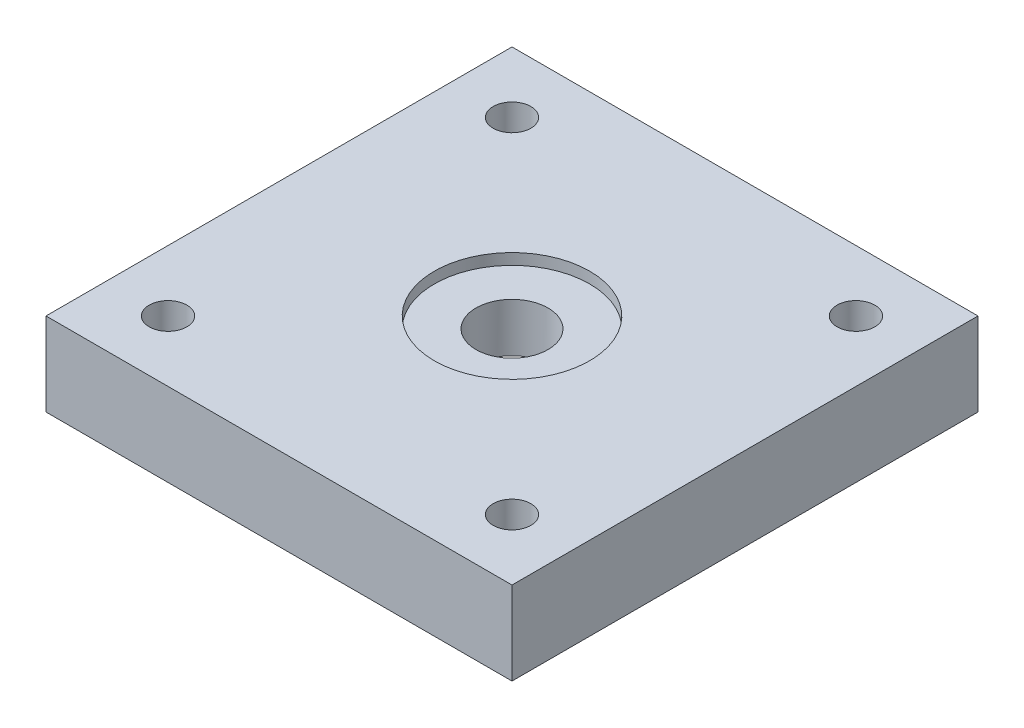
ISO-10303-21;
HEADER;
FILE_DESCRIPTION(('STEP AP214'),'2;1');
FILE_NAME('part.step','',(''),(''),'','','');
FILE_SCHEMA(('AUTOMOTIVE_DESIGN { 1 0 10303 214 1 1 1 1 }'));
ENDSEC;
DATA;
#1=APPLICATION_CONTEXT('core data for automotive mechanical design processes');
#2=APPLICATION_PROTOCOL_DEFINITION('international standard','automotive_design',2000,#1);
#3=PRODUCT_CONTEXT('',#1,'mechanical');
#4=PRODUCT('Part','Part','',(#3));
#5=PRODUCT_RELATED_PRODUCT_CATEGORY('part','',(#4));
#6=PRODUCT_DEFINITION_FORMATION('','',#4);
#7=PRODUCT_DEFINITION_CONTEXT('part definition',#1,'design');
#8=PRODUCT_DEFINITION('design','',#6,#7);
#9=PRODUCT_DEFINITION_SHAPE('','',#8);
#10=(LENGTH_UNIT() NAMED_UNIT(*) SI_UNIT(.MILLI.,.METRE.));
#11=(NAMED_UNIT(*) PLANE_ANGLE_UNIT() SI_UNIT($,.RADIAN.));
#12=(NAMED_UNIT(*) SI_UNIT($,.STERADIAN.) SOLID_ANGLE_UNIT());
#13=UNCERTAINTY_MEASURE_WITH_UNIT(LENGTH_MEASURE(1.E-05),#10,'distance_accuracy_value','');
#14=(GEOMETRIC_REPRESENTATION_CONTEXT(3) GLOBAL_UNCERTAINTY_ASSIGNED_CONTEXT((#13)) GLOBAL_UNIT_ASSIGNED_CONTEXT((#10,
#11,#12)) REPRESENTATION_CONTEXT('',''));
#15=CARTESIAN_POINT('',(0.,0.,0.));
#16=DIRECTION('',(0.,0.,1.));
#17=DIRECTION('',(1.,0.,0.));
#18=AXIS2_PLACEMENT_3D('',#15,#16,#17);
#19=CARTESIAN_POINT('',(0.,7.5,0.));
#20=DIRECTION('',(0.,-1.,0.));
#21=DIRECTION('',(0.,0.,-1.));
#22=AXIS2_PLACEMENT_3D('',#19,#20,#21);
#23=PLANE('',#22);
#24=CARTESIAN_POINT('',(0.,7.5,0.));
#25=DIRECTION('',(0.,1.,0.));
#26=DIRECTION('',(0.,0.,1.));
#27=AXIS2_PLACEMENT_3D('',#24,#25,#26);
#28=CIRCLE('',#27,7.);
#29=CARTESIAN_POINT('',(0.,7.5,7.));
#30=VERTEX_POINT('',#29);
#31=EDGE_CURVE('E174',#30,#30,#28,.T.);
#32=ORIENTED_EDGE('',*,*,#31,.F.);
#33=EDGE_LOOP('',(#32));
#34=FACE_BOUND('',#33,.T.);
#35=DIRECTION('',(0.,0.,-1.));
#36=VECTOR('',#35,1.);
#37=CARTESIAN_POINT('',(21.,7.5,21.));
#38=LINE('',#37,#36);
#39=CARTESIAN_POINT('',(21.,7.5,21.));
#40=VERTEX_POINT('',#39);
#41=CARTESIAN_POINT('',(21.,7.5,-21.));
#42=VERTEX_POINT('',#41);
#43=EDGE_CURVE('E92',#40,#42,#38,.T.);
#44=ORIENTED_EDGE('',*,*,#43,.T.);
#45=DIRECTION('',(-1.,0.,0.));
#46=VECTOR('',#45,1.);
#47=CARTESIAN_POINT('',(-21.,7.5,-21.));
#48=LINE('',#47,#46);
#49=CARTESIAN_POINT('',(-21.,7.5,-21.));
#50=VERTEX_POINT('',#49);
#51=EDGE_CURVE('E87',#42,#50,#48,.T.);
#52=ORIENTED_EDGE('',*,*,#51,.T.);
#53=DIRECTION('',(0.,0.,1.));
#54=VECTOR('',#53,1.);
#55=CARTESIAN_POINT('',(-21.,7.5,21.));
#56=LINE('',#55,#54);
#57=CARTESIAN_POINT('',(-21.,7.5,21.));
#58=VERTEX_POINT('',#57);
#59=EDGE_CURVE('E90',#50,#58,#56,.T.);
#60=ORIENTED_EDGE('',*,*,#59,.T.);
#61=DIRECTION('',(1.,0.,0.));
#62=VECTOR('',#61,1.);
#63=CARTESIAN_POINT('',(-21.,7.5,21.));
#64=LINE('',#63,#62);
#65=EDGE_CURVE('E57',#58,#40,#64,.T.);
#66=ORIENTED_EDGE('',*,*,#65,.T.);
#67=EDGE_LOOP('',(#44,#52,#60,#66));
#68=FACE_BOUND('',#67,.T.);
#69=CARTESIAN_POINT('',(-15.5,7.5,-15.5));
#70=DIRECTION('',(0.,1.,0.));
#71=DIRECTION('',(0.,0.,1.));
#72=AXIS2_PLACEMENT_3D('',#69,#70,#71);
#73=CIRCLE('',#72,1.7);
#74=CARTESIAN_POINT('',(-15.5,7.5,-13.8));
#75=VERTEX_POINT('',#74);
#76=EDGE_CURVE('E114',#75,#75,#73,.T.);
#77=ORIENTED_EDGE('',*,*,#76,.F.);
#78=EDGE_LOOP('',(#77));
#79=FACE_BOUND('',#78,.T.);
#80=CARTESIAN_POINT('',(15.5,7.5,-15.5));
#81=DIRECTION('',(0.,1.,0.));
#82=DIRECTION('',(0.,0.,1.));
#83=AXIS2_PLACEMENT_3D('',#80,#81,#82);
#84=CIRCLE('',#83,1.7);
#85=CARTESIAN_POINT('',(15.5,7.5,-13.8));
#86=VERTEX_POINT('',#85);
#87=EDGE_CURVE('E138',#86,#86,#84,.T.);
#88=ORIENTED_EDGE('',*,*,#87,.F.);
#89=EDGE_LOOP('',(#88));
#90=FACE_BOUND('',#89,.T.);
#91=CARTESIAN_POINT('',(15.5,7.5,15.5));
#92=DIRECTION('',(0.,1.,0.));
#93=DIRECTION('',(0.,0.,1.));
#94=AXIS2_PLACEMENT_3D('',#91,#92,#93);
#95=CIRCLE('',#94,1.7);
#96=CARTESIAN_POINT('',(15.5,7.5,17.2));
#97=VERTEX_POINT('',#96);
#98=EDGE_CURVE('E146',#97,#97,#95,.T.);
#99=ORIENTED_EDGE('',*,*,#98,.F.);
#100=EDGE_LOOP('',(#99));
#101=FACE_BOUND('',#100,.T.);
#102=CARTESIAN_POINT('',(-15.5,7.5,15.5));
#103=DIRECTION('',(0.,1.,0.));
#104=DIRECTION('',(0.,0.,1.));
#105=AXIS2_PLACEMENT_3D('',#102,#103,#104);
#106=CIRCLE('',#105,1.7);
#107=CARTESIAN_POINT('',(-15.5,7.5,17.2));
#108=VERTEX_POINT('',#107);
#109=EDGE_CURVE('E154',#108,#108,#106,.T.);
#110=ORIENTED_EDGE('',*,*,#109,.F.);
#111=EDGE_LOOP('',(#110));
#112=FACE_BOUND('',#111,.T.);
#113=ADVANCED_FACE('F38',(#34,#68,#79,#90,#101,#112),#23,.F.);
#114=CARTESIAN_POINT('',(0.,0.,0.));
#115=DIRECTION('',(0.,-1.,0.));
#116=DIRECTION('',(0.,0.,-1.));
#117=AXIS2_PLACEMENT_3D('',#114,#115,#116);
#118=PLANE('',#117);
#119=CARTESIAN_POINT('',(0.,0.,0.));
#120=DIRECTION('',(0.,-1.,0.));
#121=DIRECTION('',(0.,0.,-1.));
#122=AXIS2_PLACEMENT_3D('',#119,#120,#121);
#123=CIRCLE('',#122,11.);
#124=CARTESIAN_POINT('',(0.,0.,-11.));
#125=VERTEX_POINT('',#124);
#126=EDGE_CURVE('E166',#125,#125,#123,.T.);
#127=ORIENTED_EDGE('',*,*,#126,.F.);
#128=EDGE_LOOP('',(#127));
#129=FACE_BOUND('',#128,.T.);
#130=CARTESIAN_POINT('',(15.5,0.,15.5));
#131=DIRECTION('',(0.,1.,0.));
#132=DIRECTION('',(0.,0.,1.));
#133=AXIS2_PLACEMENT_3D('',#130,#131,#132);
#134=CIRCLE('',#133,1.7);
#135=CARTESIAN_POINT('',(15.5,0.,17.2));
#136=VERTEX_POINT('',#135);
#137=EDGE_CURVE('E150',#136,#136,#134,.T.);
#138=ORIENTED_EDGE('',*,*,#137,.T.);
#139=EDGE_LOOP('',(#138));
#140=FACE_BOUND('',#139,.T.);
#141=CARTESIAN_POINT('',(-15.5,0.,-15.5));
#142=DIRECTION('',(0.,1.,0.));
#143=DIRECTION('',(0.,0.,1.));
#144=AXIS2_PLACEMENT_3D('',#141,#142,#143);
#145=CIRCLE('',#144,1.7);
#146=CARTESIAN_POINT('',(-15.5,0.,-13.8));
#147=VERTEX_POINT('',#146);
#148=EDGE_CURVE('E134',#147,#147,#145,.T.);
#149=ORIENTED_EDGE('',*,*,#148,.T.);
#150=EDGE_LOOP('',(#149));
#151=FACE_BOUND('',#150,.T.);
#152=DIRECTION('',(0.,0.,-1.));
#153=VECTOR('',#152,1.);
#154=CARTESIAN_POINT('',(21.,0.,21.));
#155=LINE('',#154,#153);
#156=CARTESIAN_POINT('',(21.,0.,21.));
#157=VERTEX_POINT('',#156);
#158=CARTESIAN_POINT('',(21.,0.,-21.));
#159=VERTEX_POINT('',#158);
#160=EDGE_CURVE('E110',#157,#159,#155,.T.);
#161=ORIENTED_EDGE('',*,*,#160,.F.);
#162=DIRECTION('',(1.,0.,0.));
#163=VECTOR('',#162,1.);
#164=CARTESIAN_POINT('',(-21.,0.,21.));
#165=LINE('',#164,#163);
#166=CARTESIAN_POINT('',(-21.,0.,21.));
#167=VERTEX_POINT('',#166);
#168=EDGE_CURVE('E80',#167,#157,#165,.T.);
#169=ORIENTED_EDGE('',*,*,#168,.F.);
#170=DIRECTION('',(0.,0.,1.));
#171=VECTOR('',#170,1.);
#172=CARTESIAN_POINT('',(-21.,0.,21.));
#173=LINE('',#172,#171);
#174=CARTESIAN_POINT('',(-21.,0.,-21.));
#175=VERTEX_POINT('',#174);
#176=EDGE_CURVE('E74',#175,#167,#173,.T.);
#177=ORIENTED_EDGE('',*,*,#176,.F.);
#178=DIRECTION('',(-1.,0.,0.));
#179=VECTOR('',#178,1.);
#180=CARTESIAN_POINT('',(-21.,0.,-21.));
#181=LINE('',#180,#179);
#182=EDGE_CURVE('E97',#159,#175,#181,.T.);
#183=ORIENTED_EDGE('',*,*,#182,.F.);
#184=EDGE_LOOP('',(#161,#169,#177,#183));
#185=FACE_BOUND('',#184,.T.);
#186=CARTESIAN_POINT('',(15.5,0.,-15.5));
#187=DIRECTION('',(0.,1.,0.));
#188=DIRECTION('',(0.,0.,1.));
#189=AXIS2_PLACEMENT_3D('',#186,#187,#188);
#190=CIRCLE('',#189,1.7);
#191=CARTESIAN_POINT('',(15.5,0.,-13.8));
#192=VERTEX_POINT('',#191);
#193=EDGE_CURVE('E142',#192,#192,#190,.T.);
#194=ORIENTED_EDGE('',*,*,#193,.T.);
#195=EDGE_LOOP('',(#194));
#196=FACE_BOUND('',#195,.T.);
#197=CARTESIAN_POINT('',(-15.5,0.,15.5));
#198=DIRECTION('',(0.,1.,0.));
#199=DIRECTION('',(0.,0.,1.));
#200=AXIS2_PLACEMENT_3D('',#197,#198,#199);
#201=CIRCLE('',#200,1.7);
#202=CARTESIAN_POINT('',(-15.5,0.,17.2));
#203=VERTEX_POINT('',#202);
#204=EDGE_CURVE('E158',#203,#203,#201,.T.);
#205=ORIENTED_EDGE('',*,*,#204,.T.);
#206=EDGE_LOOP('',(#205));
#207=FACE_BOUND('',#206,.T.);
#208=ADVANCED_FACE('F128',(#129,#140,#151,#185,#196,#207),#118,.T.);
#209=CARTESIAN_POINT('',(21.,7.5,21.));
#210=DIRECTION('',(-1.,0.,0.));
#211=DIRECTION('',(0.,0.,1.));
#212=AXIS2_PLACEMENT_3D('',#209,#210,#211);
#213=PLANE('',#212);
#214=ORIENTED_EDGE('',*,*,#160,.T.);
#215=DIRECTION('',(0.,-1.,0.));
#216=VECTOR('',#215,1.);
#217=CARTESIAN_POINT('',(21.,7.5,-21.));
#218=LINE('',#217,#216);
#219=EDGE_CURVE('E11',#42,#159,#218,.T.);
#220=ORIENTED_EDGE('',*,*,#219,.F.);
#221=ORIENTED_EDGE('',*,*,#43,.F.);
#222=DIRECTION('',(0.,-1.,0.));
#223=VECTOR('',#222,1.);
#224=CARTESIAN_POINT('',(21.,7.5,21.));
#225=LINE('',#224,#223);
#226=EDGE_CURVE('E106',#40,#157,#225,.T.);
#227=ORIENTED_EDGE('',*,*,#226,.T.);
#228=EDGE_LOOP('',(#214,#220,#221,#227));
#229=FACE_BOUND('',#228,.T.);
#230=ADVANCED_FACE('F40',(#229),#213,.F.);
#231=CARTESIAN_POINT('',(-21.,7.5,-21.));
#232=DIRECTION('',(0.,0.,1.));
#233=DIRECTION('',(1.,0.,0.));
#234=AXIS2_PLACEMENT_3D('',#231,#232,#233);
#235=PLANE('',#234);
#236=ORIENTED_EDGE('',*,*,#182,.T.);
#237=DIRECTION('',(0.,-1.,0.));
#238=VECTOR('',#237,1.);
#239=CARTESIAN_POINT('',(-21.,7.5,-21.));
#240=LINE('',#239,#238);
#241=EDGE_CURVE('E49',#50,#175,#240,.T.);
#242=ORIENTED_EDGE('',*,*,#241,.F.);
#243=ORIENTED_EDGE('',*,*,#51,.F.);
#244=ORIENTED_EDGE('',*,*,#219,.T.);
#245=EDGE_LOOP('',(#236,#242,#243,#244));
#246=FACE_BOUND('',#245,.T.);
#247=ADVANCED_FACE('F96',(#246),#235,.F.);
#248=CARTESIAN_POINT('',(-21.,7.5,21.));
#249=DIRECTION('',(1.,0.,0.));
#250=DIRECTION('',(0.,0.,-1.));
#251=AXIS2_PLACEMENT_3D('',#248,#249,#250);
#252=PLANE('',#251);
#253=ORIENTED_EDGE('',*,*,#176,.T.);
#254=DIRECTION('',(0.,-1.,0.));
#255=VECTOR('',#254,1.);
#256=CARTESIAN_POINT('',(-21.,7.5,21.));
#257=LINE('',#256,#255);
#258=EDGE_CURVE('E99',#58,#167,#257,.T.);
#259=ORIENTED_EDGE('',*,*,#258,.F.);
#260=ORIENTED_EDGE('',*,*,#59,.F.);
#261=ORIENTED_EDGE('',*,*,#241,.T.);
#262=EDGE_LOOP('',(#253,#259,#260,#261));
#263=FACE_BOUND('',#262,.T.);
#264=ADVANCED_FACE('F101',(#263),#252,.F.);
#265=CARTESIAN_POINT('',(-21.,7.5,21.));
#266=DIRECTION('',(0.,0.,-1.));
#267=DIRECTION('',(-1.,0.,0.));
#268=AXIS2_PLACEMENT_3D('',#265,#266,#267);
#269=PLANE('',#268);
#270=ORIENTED_EDGE('',*,*,#168,.T.);
#271=ORIENTED_EDGE('',*,*,#226,.F.);
#272=ORIENTED_EDGE('',*,*,#65,.F.);
#273=ORIENTED_EDGE('',*,*,#258,.T.);
#274=EDGE_LOOP('',(#270,#271,#272,#273));
#275=FACE_BOUND('',#274,.T.);
#276=ADVANCED_FACE('F125',(#275),#269,.F.);
#277=CARTESIAN_POINT('',(-15.5,7.5,-15.5));
#278=DIRECTION('',(0.,-1.,0.));
#279=DIRECTION('',(0.,0.,-1.));
#280=AXIS2_PLACEMENT_3D('',#277,#278,#279);
#281=CYLINDRICAL_SURFACE('',#280,1.7);
#282=ORIENTED_EDGE('',*,*,#76,.T.);
#283=EDGE_LOOP('',(#282));
#284=FACE_BOUND('',#283,.T.);
#285=ORIENTED_EDGE('',*,*,#148,.F.);
#286=EDGE_LOOP('',(#285));
#287=FACE_BOUND('',#286,.T.);
#288=ADVANCED_FACE('F215',(#284,#287),#281,.F.);
#289=CARTESIAN_POINT('',(15.5,7.5,-15.5));
#290=DIRECTION('',(0.,-1.,0.));
#291=DIRECTION('',(0.,0.,-1.));
#292=AXIS2_PLACEMENT_3D('',#289,#290,#291);
#293=CYLINDRICAL_SURFACE('',#292,1.7);
#294=ORIENTED_EDGE('',*,*,#87,.T.);
#295=EDGE_LOOP('',(#294));
#296=FACE_BOUND('',#295,.T.);
#297=ORIENTED_EDGE('',*,*,#193,.F.);
#298=EDGE_LOOP('',(#297));
#299=FACE_BOUND('',#298,.T.);
#300=ADVANCED_FACE('F217',(#296,#299),#293,.F.);
#301=CARTESIAN_POINT('',(15.5,7.5,15.5));
#302=DIRECTION('',(0.,-1.,0.));
#303=DIRECTION('',(0.,0.,-1.));
#304=AXIS2_PLACEMENT_3D('',#301,#302,#303);
#305=CYLINDRICAL_SURFACE('',#304,1.7);
#306=ORIENTED_EDGE('',*,*,#98,.T.);
#307=EDGE_LOOP('',(#306));
#308=FACE_BOUND('',#307,.T.);
#309=ORIENTED_EDGE('',*,*,#137,.F.);
#310=EDGE_LOOP('',(#309));
#311=FACE_BOUND('',#310,.T.);
#312=ADVANCED_FACE('F224',(#308,#311),#305,.F.);
#313=CARTESIAN_POINT('',(-15.5,7.5,15.5));
#314=DIRECTION('',(0.,-1.,0.));
#315=DIRECTION('',(0.,0.,-1.));
#316=AXIS2_PLACEMENT_3D('',#313,#314,#315);
#317=CYLINDRICAL_SURFACE('',#316,1.7);
#318=ORIENTED_EDGE('',*,*,#109,.T.);
#319=EDGE_LOOP('',(#318));
#320=FACE_BOUND('',#319,.T.);
#321=ORIENTED_EDGE('',*,*,#204,.F.);
#322=EDGE_LOOP('',(#321));
#323=FACE_BOUND('',#322,.T.);
#324=ADVANCED_FACE('F204',(#320,#323),#317,.F.);
#325=CARTESIAN_POINT('',(0.,2.1,0.));
#326=DIRECTION('',(0.,-1.,0.));
#327=DIRECTION('',(0.,0.,-1.));
#328=AXIS2_PLACEMENT_3D('',#325,#326,#327);
#329=CYLINDRICAL_SURFACE('',#328,11.);
#330=CARTESIAN_POINT('',(0.,2.1,0.));
#331=DIRECTION('',(0.,-1.,0.));
#332=DIRECTION('',(0.,0.,-1.));
#333=AXIS2_PLACEMENT_3D('',#330,#331,#332);
#334=CIRCLE('',#333,11.);
#335=CARTESIAN_POINT('',(0.,2.1,-11.));
#336=VERTEX_POINT('',#335);
#337=EDGE_CURVE('E162',#336,#336,#334,.T.);
#338=ORIENTED_EDGE('',*,*,#337,.F.);
#339=EDGE_LOOP('',(#338));
#340=FACE_BOUND('',#339,.T.);
#341=ORIENTED_EDGE('',*,*,#126,.T.);
#342=EDGE_LOOP('',(#341));
#343=FACE_BOUND('',#342,.T.);
#344=ADVANCED_FACE('F198',(#340,#343),#329,.F.);
#345=CARTESIAN_POINT('',(0.,2.1,0.));
#346=DIRECTION('',(0.,-1.,0.));
#347=DIRECTION('',(0.,0.,-1.));
#348=AXIS2_PLACEMENT_3D('',#345,#346,#347);
#349=PLANE('',#348);
#350=CARTESIAN_POINT('',(0.,2.1,0.));
#351=DIRECTION('',(0.,-1.,0.));
#352=DIRECTION('',(0.,0.,-1.));
#353=AXIS2_PLACEMENT_3D('',#350,#351,#352);
#354=CIRCLE('',#353,3.25);
#355=CARTESIAN_POINT('',(0.,2.1,-3.25));
#356=VERTEX_POINT('',#355);
#357=EDGE_CURVE('E42',#356,#356,#354,.T.);
#358=ORIENTED_EDGE('',*,*,#357,.F.);
#359=EDGE_LOOP('',(#358));
#360=FACE_BOUND('',#359,.T.);
#361=ORIENTED_EDGE('',*,*,#337,.T.);
#362=EDGE_LOOP('',(#361));
#363=FACE_BOUND('',#362,.T.);
#364=ADVANCED_FACE('F194',(#360,#363),#349,.T.);
#365=CARTESIAN_POINT('',(0.,6.5,0.));
#366=DIRECTION('',(0.,1.,0.));
#367=DIRECTION('',(0.,0.,1.));
#368=AXIS2_PLACEMENT_3D('',#365,#366,#367);
#369=CYLINDRICAL_SURFACE('',#368,7.);
#370=CARTESIAN_POINT('',(0.,6.5,0.));
#371=DIRECTION('',(0.,1.,0.));
#372=DIRECTION('',(0.,0.,1.));
#373=AXIS2_PLACEMENT_3D('',#370,#371,#372);
#374=CIRCLE('',#373,7.);
#375=CARTESIAN_POINT('',(0.,6.5,7.));
#376=VERTEX_POINT('',#375);
#377=EDGE_CURVE('E170',#376,#376,#374,.T.);
#378=ORIENTED_EDGE('',*,*,#377,.F.);
#379=EDGE_LOOP('',(#378));
#380=FACE_BOUND('',#379,.T.);
#381=ORIENTED_EDGE('',*,*,#31,.T.);
#382=EDGE_LOOP('',(#381));
#383=FACE_BOUND('',#382,.T.);
#384=ADVANCED_FACE('F197',(#380,#383),#369,.F.);
#385=CARTESIAN_POINT('',(0.,6.5,0.));
#386=DIRECTION('',(0.,1.,0.));
#387=DIRECTION('',(0.,0.,1.));
#388=AXIS2_PLACEMENT_3D('',#385,#386,#387);
#389=PLANE('',#388);
#390=CARTESIAN_POINT('',(0.,6.5,0.));
#391=DIRECTION('',(0.,1.,0.));
#392=DIRECTION('',(0.,0.,1.));
#393=AXIS2_PLACEMENT_3D('',#390,#391,#392);
#394=CIRCLE('',#393,3.25);
#395=CARTESIAN_POINT('',(0.,6.5,3.25));
#396=VERTEX_POINT('',#395);
#397=EDGE_CURVE('E181',#396,#396,#394,.T.);
#398=ORIENTED_EDGE('',*,*,#397,.F.);
#399=EDGE_LOOP('',(#398));
#400=FACE_BOUND('',#399,.T.);
#401=ORIENTED_EDGE('',*,*,#377,.T.);
#402=EDGE_LOOP('',(#401));
#403=FACE_BOUND('',#402,.T.);
#404=ADVANCED_FACE('F267',(#400,#403),#389,.T.);
#405=CARTESIAN_POINT('',(0.,-3.5,0.));
#406=DIRECTION('',(0.,1.,0.));
#407=DIRECTION('',(0.,0.,1.));
#408=AXIS2_PLACEMENT_3D('',#405,#406,#407);
#409=CYLINDRICAL_SURFACE('',#408,3.25);
#410=ORIENTED_EDGE('',*,*,#357,.T.);
#411=EDGE_LOOP('',(#410));
#412=FACE_BOUND('',#411,.T.);
#413=ORIENTED_EDGE('',*,*,#397,.T.);
#414=EDGE_LOOP('',(#413));
#415=FACE_BOUND('',#414,.T.);
#416=ADVANCED_FACE('F192',(#412,#415),#409,.F.);
#417=CLOSED_SHELL('',(#113,#208,#230,#247,#264,#276,#288,#300,#312,#324,#344,#364,#384,#404,#416));
#418=MANIFOLD_SOLID_BREP('B2',#417);
#419=ADVANCED_BREP_SHAPE_REPRESENTATION('',(#18,#418),#14);
#420=SHAPE_DEFINITION_REPRESENTATION(#9,#419);
ENDSEC;
END-ISO-10303-21;
